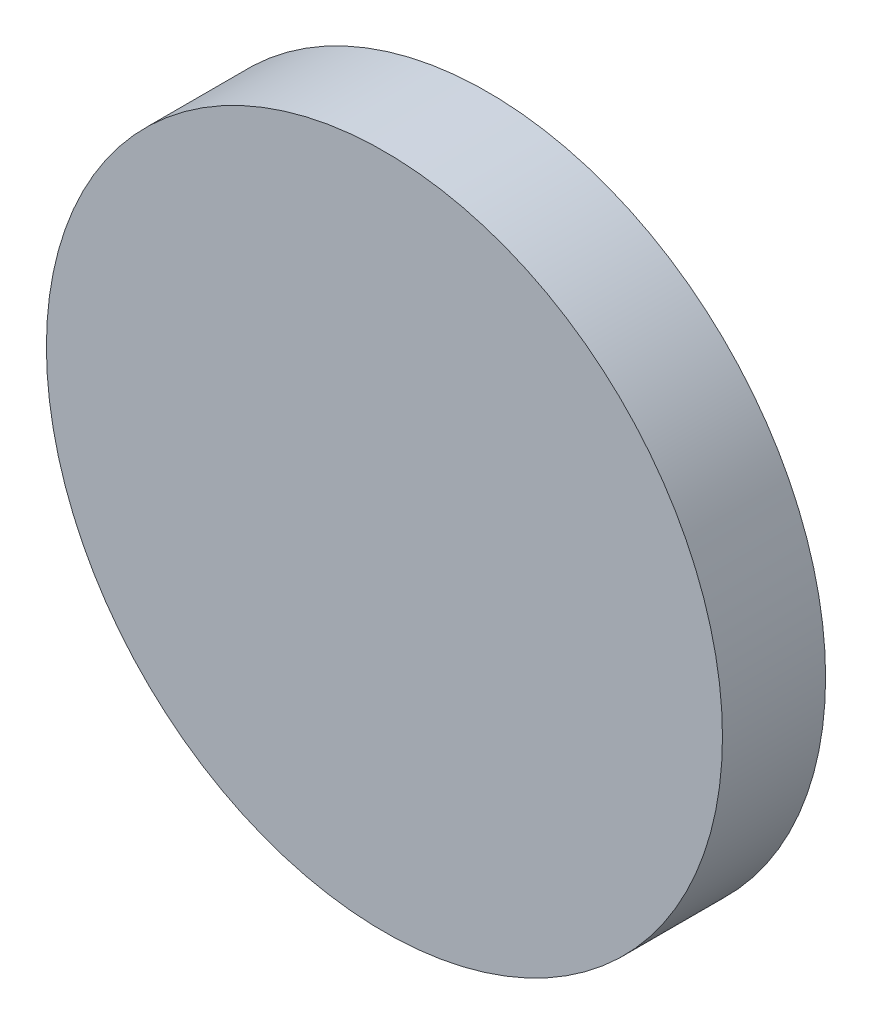
ISO-10303-21;
HEADER;
FILE_DESCRIPTION(('STEP AP214'),'2;1');
FILE_NAME('part.step','',(''),(''),'','','');
FILE_SCHEMA(('AUTOMOTIVE_DESIGN { 1 0 10303 214 1 1 1 1 }'));
ENDSEC;
DATA;
#1=APPLICATION_CONTEXT('core data for automotive mechanical design processes');
#2=APPLICATION_PROTOCOL_DEFINITION('international standard','automotive_design',2000,#1);
#3=PRODUCT_CONTEXT('',#1,'mechanical');
#4=PRODUCT('Part','Part','',(#3));
#5=PRODUCT_RELATED_PRODUCT_CATEGORY('part','',(#4));
#6=PRODUCT_DEFINITION_FORMATION('','',#4);
#7=PRODUCT_DEFINITION_CONTEXT('part definition',#1,'design');
#8=PRODUCT_DEFINITION('design','',#6,#7);
#9=PRODUCT_DEFINITION_SHAPE('','',#8);
#10=(LENGTH_UNIT() NAMED_UNIT(*) SI_UNIT(.MILLI.,.METRE.));
#11=(NAMED_UNIT(*) PLANE_ANGLE_UNIT() SI_UNIT($,.RADIAN.));
#12=(NAMED_UNIT(*) SI_UNIT($,.STERADIAN.) SOLID_ANGLE_UNIT());
#13=UNCERTAINTY_MEASURE_WITH_UNIT(LENGTH_MEASURE(1.E-05),#10,'distance_accuracy_value','');
#14=(GEOMETRIC_REPRESENTATION_CONTEXT(3) GLOBAL_UNCERTAINTY_ASSIGNED_CONTEXT((#13)) GLOBAL_UNIT_ASSIGNED_CONTEXT((#10,
#11,#12)) REPRESENTATION_CONTEXT('',''));
#15=CARTESIAN_POINT('',(0.,0.,0.));
#16=DIRECTION('',(0.,0.,1.));
#17=DIRECTION('',(1.,0.,0.));
#18=AXIS2_PLACEMENT_3D('',#15,#16,#17);
#19=CARTESIAN_POINT('',(0.,0.,0.9));
#20=DIRECTION('',(0.,0.,-1.));
#21=DIRECTION('',(-1.,0.,0.));
#22=AXIS2_PLACEMENT_3D('',#19,#20,#21);
#23=CYLINDRICAL_SURFACE('',#22,2.95);
#24=CARTESIAN_POINT('',(0.,0.,0.9));
#25=DIRECTION('',(0.,0.,1.));
#26=DIRECTION('',(1.,0.,0.));
#27=AXIS2_PLACEMENT_3D('',#24,#25,#26);
#28=CIRCLE('',#27,2.95);
#29=CARTESIAN_POINT('',(2.95,0.,0.9));
#30=VERTEX_POINT('',#29);
#31=EDGE_CURVE('E10',#30,#30,#28,.T.);
#32=ORIENTED_EDGE('',*,*,#31,.F.);
#33=EDGE_LOOP('',(#32));
#34=FACE_BOUND('',#33,.T.);
#35=CARTESIAN_POINT('',(0.,0.,0.));
#36=DIRECTION('',(0.,0.,1.));
#37=DIRECTION('',(1.,0.,0.));
#38=AXIS2_PLACEMENT_3D('',#35,#36,#37);
#39=CIRCLE('',#38,2.95);
#40=CARTESIAN_POINT('',(2.95,0.,0.));
#41=VERTEX_POINT('',#40);
#42=EDGE_CURVE('E34',#41,#41,#39,.T.);
#43=ORIENTED_EDGE('',*,*,#42,.T.);
#44=EDGE_LOOP('',(#43));
#45=FACE_BOUND('',#44,.T.);
#46=ADVANCED_FACE('F31',(#34,#45),#23,.T.);
#47=CARTESIAN_POINT('',(0.,0.,0.9));
#48=DIRECTION('',(0.,0.,1.));
#49=DIRECTION('',(1.,0.,0.));
#50=AXIS2_PLACEMENT_3D('',#47,#48,#49);
#51=PLANE('',#50);
#52=ORIENTED_EDGE('',*,*,#31,.T.);
#53=EDGE_LOOP('',(#52));
#54=FACE_BOUND('',#53,.T.);
#55=ADVANCED_FACE('F46',(#54),#51,.T.);
#56=CARTESIAN_POINT('',(0.,0.,0.));
#57=DIRECTION('',(0.,0.,1.));
#58=DIRECTION('',(1.,0.,0.));
#59=AXIS2_PLACEMENT_3D('',#56,#57,#58);
#60=PLANE('',#59);
#61=ORIENTED_EDGE('',*,*,#42,.F.);
#62=EDGE_LOOP('',(#61));
#63=FACE_BOUND('',#62,.T.);
#64=ADVANCED_FACE('F44',(#63),#60,.F.);
#65=CLOSED_SHELL('',(#46,#55,#64));
#66=MANIFOLD_SOLID_BREP('B2',#65);
#67=ADVANCED_BREP_SHAPE_REPRESENTATION('',(#18,#66),#14);
#68=SHAPE_DEFINITION_REPRESENTATION(#9,#67);
ENDSEC;
END-ISO-10303-21;
